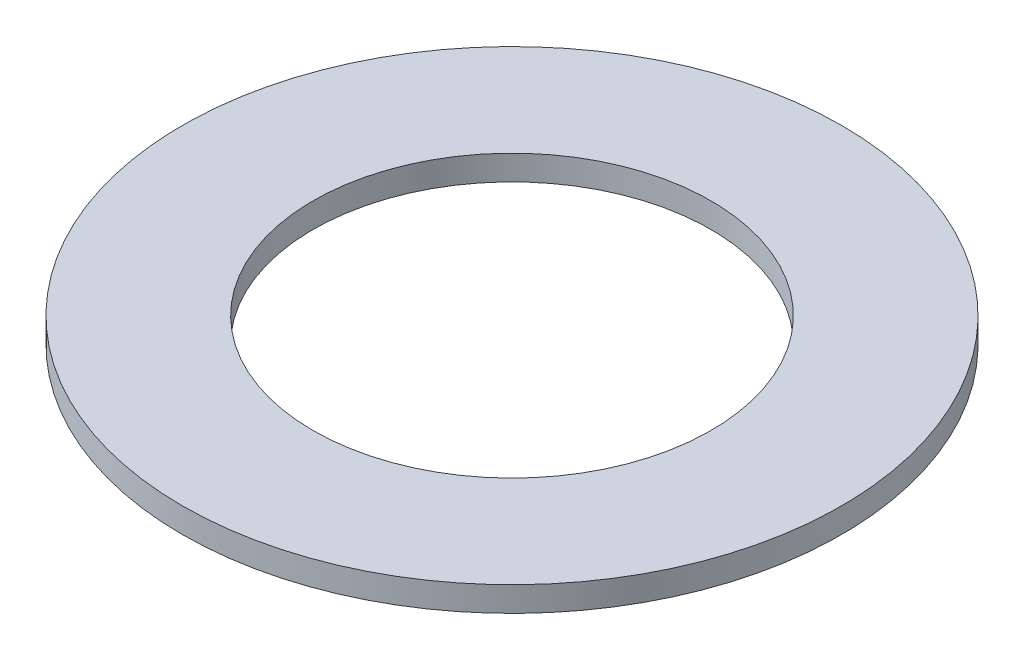
ISO-10303-21;
HEADER;
FILE_DESCRIPTION(('STEP AP214'),'2;1');
FILE_NAME('part.step','',(''),(''),'','','');
FILE_SCHEMA(('AUTOMOTIVE_DESIGN { 1 0 10303 214 1 1 1 1 }'));
ENDSEC;
DATA;
#1=APPLICATION_CONTEXT('core data for automotive mechanical design processes');
#2=APPLICATION_PROTOCOL_DEFINITION('international standard','automotive_design',2000,#1);
#3=PRODUCT_CONTEXT('',#1,'mechanical');
#4=PRODUCT('Part','Part','',(#3));
#5=PRODUCT_RELATED_PRODUCT_CATEGORY('part','',(#4));
#6=PRODUCT_DEFINITION_FORMATION('','',#4);
#7=PRODUCT_DEFINITION_CONTEXT('part definition',#1,'design');
#8=PRODUCT_DEFINITION('design','',#6,#7);
#9=PRODUCT_DEFINITION_SHAPE('','',#8);
#10=(LENGTH_UNIT() NAMED_UNIT(*) SI_UNIT(.MILLI.,.METRE.));
#11=(NAMED_UNIT(*) PLANE_ANGLE_UNIT() SI_UNIT($,.RADIAN.));
#12=(NAMED_UNIT(*) SI_UNIT($,.STERADIAN.) SOLID_ANGLE_UNIT());
#13=UNCERTAINTY_MEASURE_WITH_UNIT(LENGTH_MEASURE(1.E-05),#10,'distance_accuracy_value','');
#14=(GEOMETRIC_REPRESENTATION_CONTEXT(3) GLOBAL_UNCERTAINTY_ASSIGNED_CONTEXT((#13)) GLOBAL_UNIT_ASSIGNED_CONTEXT((#10,
#11,#12)) REPRESENTATION_CONTEXT('',''));
#15=CARTESIAN_POINT('',(0.,0.,0.));
#16=DIRECTION('',(0.,0.,1.));
#17=DIRECTION('',(1.,0.,0.));
#18=AXIS2_PLACEMENT_3D('',#15,#16,#17);
#19=CARTESIAN_POINT('',(0.,1.,0.));
#20=DIRECTION('',(0.,1.,0.));
#21=DIRECTION('',(0.,0.,1.));
#22=AXIS2_PLACEMENT_3D('',#19,#20,#21);
#23=PLANE('',#22);
#24=CARTESIAN_POINT('',(0.,1.,0.));
#25=DIRECTION('',(0.,1.,0.));
#26=DIRECTION('',(0.,0.,1.));
#27=AXIS2_PLACEMENT_3D('',#24,#25,#26);
#28=CIRCLE('',#27,13.25);
#29=CARTESIAN_POINT('',(0.,1.,13.25));
#30=VERTEX_POINT('',#29);
#31=EDGE_CURVE('E10',#30,#30,#28,.T.);
#32=ORIENTED_EDGE('',*,*,#31,.T.);
#33=EDGE_LOOP('',(#32));
#34=FACE_BOUND('',#33,.T.);
#35=CARTESIAN_POINT('',(0.,1.,0.));
#36=DIRECTION('',(0.,1.,0.));
#37=DIRECTION('',(0.,0.,1.));
#38=AXIS2_PLACEMENT_3D('',#35,#36,#37);
#39=CIRCLE('',#38,8.);
#40=CARTESIAN_POINT('',(0.,1.,8.));
#41=VERTEX_POINT('',#40);
#42=EDGE_CURVE('E42',#41,#41,#39,.T.);
#43=ORIENTED_EDGE('',*,*,#42,.F.);
#44=EDGE_LOOP('',(#43));
#45=FACE_BOUND('',#44,.T.);
#46=ADVANCED_FACE('F31',(#34,#45),#23,.T.);
#47=CARTESIAN_POINT('',(0.,0.,0.));
#48=DIRECTION('',(0.,1.,0.));
#49=DIRECTION('',(0.,0.,1.));
#50=AXIS2_PLACEMENT_3D('',#47,#48,#49);
#51=PLANE('',#50);
#52=CARTESIAN_POINT('',(0.,0.,0.));
#53=DIRECTION('',(0.,1.,0.));
#54=DIRECTION('',(0.,0.,1.));
#55=AXIS2_PLACEMENT_3D('',#52,#53,#54);
#56=CIRCLE('',#55,13.25);
#57=CARTESIAN_POINT('',(0.,0.,13.25));
#58=VERTEX_POINT('',#57);
#59=EDGE_CURVE('E35',#58,#58,#56,.T.);
#60=ORIENTED_EDGE('',*,*,#59,.F.);
#61=EDGE_LOOP('',(#60));
#62=FACE_BOUND('',#61,.T.);
#63=CARTESIAN_POINT('',(0.,0.,0.));
#64=DIRECTION('',(0.,1.,0.));
#65=DIRECTION('',(0.,0.,1.));
#66=AXIS2_PLACEMENT_3D('',#63,#64,#65);
#67=CIRCLE('',#66,8.);
#68=CARTESIAN_POINT('',(0.,0.,8.));
#69=VERTEX_POINT('',#68);
#70=EDGE_CURVE('E44',#69,#69,#67,.T.);
#71=ORIENTED_EDGE('',*,*,#70,.T.);
#72=EDGE_LOOP('',(#71));
#73=FACE_BOUND('',#72,.T.);
#74=ADVANCED_FACE('F54',(#62,#73),#51,.F.);
#75=CARTESIAN_POINT('',(0.,1.,0.));
#76=DIRECTION('',(0.,-1.,0.));
#77=DIRECTION('',(0.,0.,-1.));
#78=AXIS2_PLACEMENT_3D('',#75,#76,#77);
#79=CYLINDRICAL_SURFACE('',#78,13.25);
#80=ORIENTED_EDGE('',*,*,#31,.F.);
#81=EDGE_LOOP('',(#80));
#82=FACE_BOUND('',#81,.T.);
#83=ORIENTED_EDGE('',*,*,#59,.T.);
#84=EDGE_LOOP('',(#83));
#85=FACE_BOUND('',#84,.T.);
#86=ADVANCED_FACE('F33',(#82,#85),#79,.T.);
#87=CARTESIAN_POINT('',(0.,1.,0.));
#88=DIRECTION('',(0.,-1.,0.));
#89=DIRECTION('',(0.,0.,-1.));
#90=AXIS2_PLACEMENT_3D('',#87,#88,#89);
#91=CYLINDRICAL_SURFACE('',#90,8.);
#92=ORIENTED_EDGE('',*,*,#42,.T.);
#93=EDGE_LOOP('',(#92));
#94=FACE_BOUND('',#93,.T.);
#95=ORIENTED_EDGE('',*,*,#70,.F.);
#96=EDGE_LOOP('',(#95));
#97=FACE_BOUND('',#96,.T.);
#98=ADVANCED_FACE('F50',(#94,#97),#91,.F.);
#99=CLOSED_SHELL('',(#46,#74,#86,#98));
#100=MANIFOLD_SOLID_BREP('B2',#99);
#101=ADVANCED_BREP_SHAPE_REPRESENTATION('',(#18,#100),#14);
#102=SHAPE_DEFINITION_REPRESENTATION(#9,#101);
ENDSEC;
END-ISO-10303-21;
